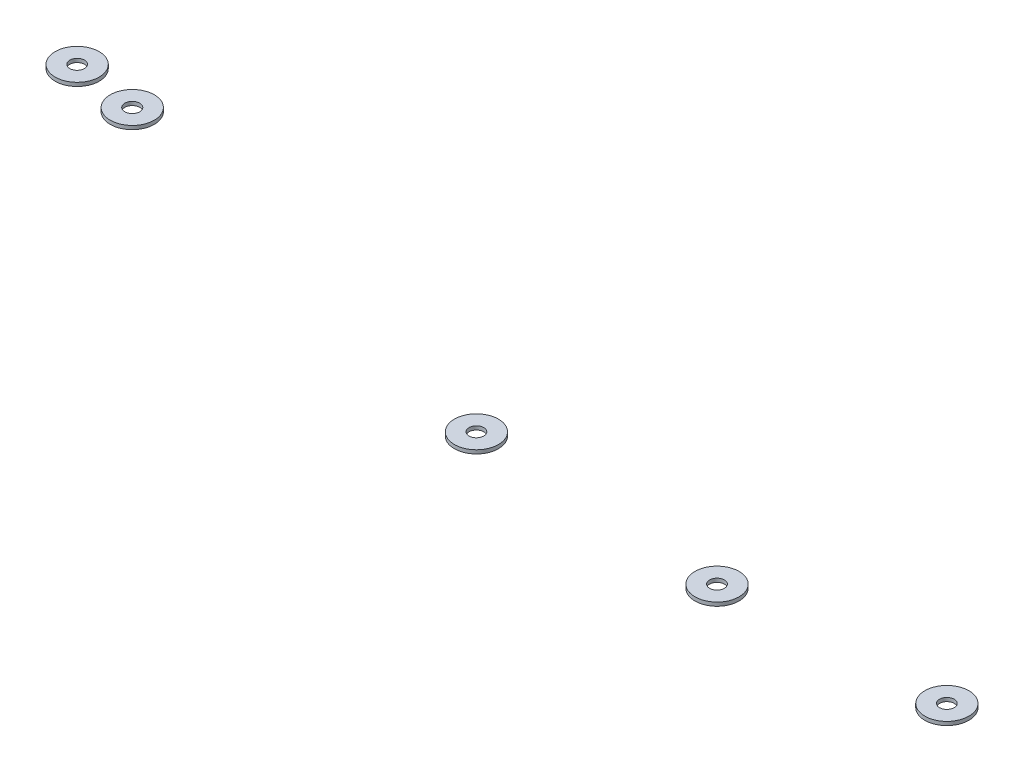
ISO-10303-21;
HEADER;
FILE_DESCRIPTION(('STEP AP214'),'2;1');
FILE_NAME('part.step','',(''),(''),'','','');
FILE_SCHEMA(('AUTOMOTIVE_DESIGN { 1 0 10303 214 1 1 1 1 }'));
ENDSEC;
DATA;
#1=APPLICATION_CONTEXT('core data for automotive mechanical design processes');
#2=APPLICATION_PROTOCOL_DEFINITION('international standard','automotive_design',2000,#1);
#3=PRODUCT_CONTEXT('',#1,'mechanical');
#4=PRODUCT('Part','Part','',(#3));
#5=PRODUCT_RELATED_PRODUCT_CATEGORY('part','',(#4));
#6=PRODUCT_DEFINITION_FORMATION('','',#4);
#7=PRODUCT_DEFINITION_CONTEXT('part definition',#1,'design');
#8=PRODUCT_DEFINITION('design','',#6,#7);
#9=PRODUCT_DEFINITION_SHAPE('','',#8);
#10=(LENGTH_UNIT() NAMED_UNIT(*) SI_UNIT(.MILLI.,.METRE.));
#11=(NAMED_UNIT(*) PLANE_ANGLE_UNIT() SI_UNIT($,.RADIAN.));
#12=(NAMED_UNIT(*) SI_UNIT($,.STERADIAN.) SOLID_ANGLE_UNIT());
#13=UNCERTAINTY_MEASURE_WITH_UNIT(LENGTH_MEASURE(1.E-05),#10,'distance_accuracy_value','');
#14=(GEOMETRIC_REPRESENTATION_CONTEXT(3) GLOBAL_UNCERTAINTY_ASSIGNED_CONTEXT((#13)) GLOBAL_UNIT_ASSIGNED_CONTEXT((#10,
#11,#12)) REPRESENTATION_CONTEXT('',''));
#15=CARTESIAN_POINT('',(0.,0.,0.));
#16=DIRECTION('',(0.,0.,1.));
#17=DIRECTION('',(1.,0.,0.));
#18=AXIS2_PLACEMENT_3D('',#15,#16,#17);
#19=CARTESIAN_POINT('',(-364.051137420954,706.3,-296.101801858513));
#20=DIRECTION('',(0.,1.,0.));
#21=DIRECTION('',(0.,0.,-1.));
#22=AXIS2_PLACEMENT_3D('',#19,#20,#21);
#23=PLANE('',#22);
#24=CARTESIAN_POINT('',(-364.051137420954,706.3,-296.101801858513));
#25=DIRECTION('',(0.,-1.,0.));
#26=DIRECTION('',(0.,0.,-1.));
#27=AXIS2_PLACEMENT_3D('',#24,#25,#26);
#28=CIRCLE('',#27,5.99999999999999);
#29=CARTESIAN_POINT('',(-364.051137420954,706.3,-302.101801858513));
#30=VERTEX_POINT('',#29);
#31=EDGE_CURVE('E11',#30,#30,#28,.T.);
#32=ORIENTED_EDGE('',*,*,#31,.F.);
#33=EDGE_LOOP('',(#32));
#34=FACE_BOUND('',#33,.T.);
#35=CARTESIAN_POINT('',(-364.051137420954,706.3,-296.101801858513));
#36=DIRECTION('',(0.,-1.,0.));
#37=DIRECTION('',(0.,0.,-1.));
#38=AXIS2_PLACEMENT_3D('',#35,#36,#37);
#39=CIRCLE('',#38,2.);
#40=CARTESIAN_POINT('',(-364.051137420954,706.3,-298.101801858513));
#41=VERTEX_POINT('',#40);
#42=EDGE_CURVE('E55',#41,#41,#39,.T.);
#43=ORIENTED_EDGE('',*,*,#42,.T.);
#44=EDGE_LOOP('',(#43));
#45=FACE_BOUND('',#44,.T.);
#46=ADVANCED_FACE('F44',(#34,#45),#23,.T.);
#47=CARTESIAN_POINT('',(-364.051137420954,705.3,-296.101801858513));
#48=DIRECTION('',(0.,1.,0.));
#49=DIRECTION('',(0.,0.,-1.));
#50=AXIS2_PLACEMENT_3D('',#47,#48,#49);
#51=PLANE('',#50);
#52=CARTESIAN_POINT('',(-364.051137420954,705.3,-296.101801858513));
#53=DIRECTION('',(0.,-1.,0.));
#54=DIRECTION('',(0.,0.,-1.));
#55=AXIS2_PLACEMENT_3D('',#52,#53,#54);
#56=CIRCLE('',#55,5.99999999999999);
#57=CARTESIAN_POINT('',(-364.051137420954,705.3,-302.101801858513));
#58=VERTEX_POINT('',#57);
#59=EDGE_CURVE('E48',#58,#58,#56,.T.);
#60=ORIENTED_EDGE('',*,*,#59,.T.);
#61=EDGE_LOOP('',(#60));
#62=FACE_BOUND('',#61,.T.);
#63=CARTESIAN_POINT('',(-364.051137420954,705.3,-296.101801858513));
#64=DIRECTION('',(0.,-1.,0.));
#65=DIRECTION('',(0.,0.,-1.));
#66=AXIS2_PLACEMENT_3D('',#63,#64,#65);
#67=CIRCLE('',#66,2.);
#68=CARTESIAN_POINT('',(-364.051137420954,705.3,-298.101801858513));
#69=VERTEX_POINT('',#68);
#70=EDGE_CURVE('E57',#69,#69,#67,.T.);
#71=ORIENTED_EDGE('',*,*,#70,.F.);
#72=EDGE_LOOP('',(#71));
#73=FACE_BOUND('',#72,.T.);
#74=ADVANCED_FACE('F70',(#62,#73),#51,.F.);
#75=CARTESIAN_POINT('',(-364.051137420954,706.3,-296.101801858513));
#76=DIRECTION('',(0.,-1.,0.));
#77=DIRECTION('',(0.,0.,1.));
#78=AXIS2_PLACEMENT_3D('',#75,#76,#77);
#79=CYLINDRICAL_SURFACE('',#78,5.99999999999999);
#80=ORIENTED_EDGE('',*,*,#31,.T.);
#81=EDGE_LOOP('',(#80));
#82=FACE_BOUND('',#81,.T.);
#83=ORIENTED_EDGE('',*,*,#59,.F.);
#84=EDGE_LOOP('',(#83));
#85=FACE_BOUND('',#84,.T.);
#86=ADVANCED_FACE('F46',(#82,#85),#79,.T.);
#87=CARTESIAN_POINT('',(-364.051137420954,706.3,-296.101801858513));
#88=DIRECTION('',(0.,-1.,0.));
#89=DIRECTION('',(0.,0.,1.));
#90=AXIS2_PLACEMENT_3D('',#87,#88,#89);
#91=CYLINDRICAL_SURFACE('',#90,2.);
#92=ORIENTED_EDGE('',*,*,#42,.F.);
#93=EDGE_LOOP('',(#92));
#94=FACE_BOUND('',#93,.T.);
#95=ORIENTED_EDGE('',*,*,#70,.T.);
#96=EDGE_LOOP('',(#95));
#97=FACE_BOUND('',#96,.T.);
#98=ADVANCED_FACE('F64',(#94,#97),#91,.F.);
#99=CLOSED_SHELL('',(#46,#74,#86,#98));
#100=MANIFOLD_SOLID_BREP('B2',#99);
#101=CARTESIAN_POINT('',(-346.372819063942,706.3,-293.429327819401));
#102=DIRECTION('',(0.,1.,0.));
#103=DIRECTION('',(0.,0.,-1.));
#104=AXIS2_PLACEMENT_3D('',#101,#102,#103);
#105=PLANE('',#104);
#106=CARTESIAN_POINT('',(-346.372819063942,706.3,-293.429327819401));
#107=DIRECTION('',(0.,-1.,0.));
#108=DIRECTION('',(0.,0.,-1.));
#109=AXIS2_PLACEMENT_3D('',#106,#107,#108);
#110=CIRCLE('',#109,5.99999999999999);
#111=CARTESIAN_POINT('',(-346.372819063942,706.3,-299.429327819401));
#112=VERTEX_POINT('',#111);
#113=EDGE_CURVE('E43',#112,#112,#110,.T.);
#114=ORIENTED_EDGE('',*,*,#113,.F.);
#115=EDGE_LOOP('',(#114));
#116=FACE_BOUND('',#115,.T.);
#117=CARTESIAN_POINT('',(-346.372819063942,706.3,-293.429327819401));
#118=DIRECTION('',(0.,-1.,0.));
#119=DIRECTION('',(0.,0.,-1.));
#120=AXIS2_PLACEMENT_3D('',#117,#118,#119);
#121=CIRCLE('',#120,2.0342194785771);
#122=CARTESIAN_POINT('',(-346.372819063942,706.3,-295.463547297979));
#123=VERTEX_POINT('',#122);
#124=EDGE_CURVE('E125',#123,#123,#121,.T.);
#125=ORIENTED_EDGE('',*,*,#124,.T.);
#126=EDGE_LOOP('',(#125));
#127=FACE_BOUND('',#126,.T.);
#128=ADVANCED_FACE('F114',(#116,#127),#105,.T.);
#129=CARTESIAN_POINT('',(-346.372819063942,705.3,-293.429327819401));
#130=DIRECTION('',(0.,1.,0.));
#131=DIRECTION('',(0.,0.,-1.));
#132=AXIS2_PLACEMENT_3D('',#129,#130,#131);
#133=PLANE('',#132);
#134=CARTESIAN_POINT('',(-346.372819063942,705.3,-293.429327819401));
#135=DIRECTION('',(0.,-1.,0.));
#136=DIRECTION('',(0.,0.,-1.));
#137=AXIS2_PLACEMENT_3D('',#134,#135,#136);
#138=CIRCLE('',#137,5.99999999999999);
#139=CARTESIAN_POINT('',(-346.372819063942,705.3,-299.429327819401));
#140=VERTEX_POINT('',#139);
#141=EDGE_CURVE('E118',#140,#140,#138,.T.);
#142=ORIENTED_EDGE('',*,*,#141,.T.);
#143=EDGE_LOOP('',(#142));
#144=FACE_BOUND('',#143,.T.);
#145=CARTESIAN_POINT('',(-346.372819063942,705.3,-293.429327819401));
#146=DIRECTION('',(0.,-1.,0.));
#147=DIRECTION('',(0.,0.,-1.));
#148=AXIS2_PLACEMENT_3D('',#145,#146,#147);
#149=CIRCLE('',#148,2.0342194785771);
#150=CARTESIAN_POINT('',(-346.372819063942,705.3,-295.463547297979));
#151=VERTEX_POINT('',#150);
#152=EDGE_CURVE('E127',#151,#151,#149,.T.);
#153=ORIENTED_EDGE('',*,*,#152,.F.);
#154=EDGE_LOOP('',(#153));
#155=FACE_BOUND('',#154,.T.);
#156=ADVANCED_FACE('F140',(#144,#155),#133,.F.);
#157=CARTESIAN_POINT('',(-346.372819063942,706.3,-293.429327819401));
#158=DIRECTION('',(0.,-1.,0.));
#159=DIRECTION('',(0.,0.,1.));
#160=AXIS2_PLACEMENT_3D('',#157,#158,#159);
#161=CYLINDRICAL_SURFACE('',#160,5.99999999999999);
#162=ORIENTED_EDGE('',*,*,#113,.T.);
#163=EDGE_LOOP('',(#162));
#164=FACE_BOUND('',#163,.T.);
#165=ORIENTED_EDGE('',*,*,#141,.F.);
#166=EDGE_LOOP('',(#165));
#167=FACE_BOUND('',#166,.T.);
#168=ADVANCED_FACE('F116',(#164,#167),#161,.T.);
#169=CARTESIAN_POINT('',(-346.372819063942,706.3,-293.429327819401));
#170=DIRECTION('',(0.,-1.,0.));
#171=DIRECTION('',(0.,0.,1.));
#172=AXIS2_PLACEMENT_3D('',#169,#170,#171);
#173=CYLINDRICAL_SURFACE('',#172,2.0342194785771);
#174=ORIENTED_EDGE('',*,*,#124,.F.);
#175=EDGE_LOOP('',(#174));
#176=FACE_BOUND('',#175,.T.);
#177=ORIENTED_EDGE('',*,*,#152,.T.);
#178=EDGE_LOOP('',(#177));
#179=FACE_BOUND('',#178,.T.);
#180=ADVANCED_FACE('F134',(#176,#179),#173,.F.);
#181=CLOSED_SHELL('',(#128,#156,#168,#180));
#182=MANIFOLD_SOLID_BREP('B6',#181);
#183=CARTESIAN_POINT('',(-223.024834580686,706.3,-263.802212935845));
#184=DIRECTION('',(0.,1.,0.));
#185=DIRECTION('',(0.,0.,-1.));
#186=AXIS2_PLACEMENT_3D('',#183,#184,#185);
#187=PLANE('',#186);
#188=CARTESIAN_POINT('',(-223.024834580686,706.3,-263.802212935845));
#189=DIRECTION('',(0.,-1.,0.));
#190=DIRECTION('',(0.,0.,-1.));
#191=AXIS2_PLACEMENT_3D('',#188,#189,#190);
#192=CIRCLE('',#191,6.00000000000002);
#193=CARTESIAN_POINT('',(-223.024834580686,706.3,-269.802212935845));
#194=VERTEX_POINT('',#193);
#195=EDGE_CURVE('E113',#194,#194,#192,.T.);
#196=ORIENTED_EDGE('',*,*,#195,.F.);
#197=EDGE_LOOP('',(#196));
#198=FACE_BOUND('',#197,.T.);
#199=CARTESIAN_POINT('',(-223.024834580686,706.3,-263.802212935845));
#200=DIRECTION('',(0.,-1.,0.));
#201=DIRECTION('',(0.,0.,-1.));
#202=AXIS2_PLACEMENT_3D('',#199,#200,#201);
#203=CIRCLE('',#202,2.);
#204=CARTESIAN_POINT('',(-223.024834580686,706.3,-265.802212935845));
#205=VERTEX_POINT('',#204);
#206=EDGE_CURVE('E195',#205,#205,#203,.T.);
#207=ORIENTED_EDGE('',*,*,#206,.T.);
#208=EDGE_LOOP('',(#207));
#209=FACE_BOUND('',#208,.T.);
#210=ADVANCED_FACE('F184',(#198,#209),#187,.T.);
#211=CARTESIAN_POINT('',(-223.024834580686,705.3,-263.802212935845));
#212=DIRECTION('',(0.,1.,0.));
#213=DIRECTION('',(0.,0.,-1.));
#214=AXIS2_PLACEMENT_3D('',#211,#212,#213);
#215=PLANE('',#214);
#216=CARTESIAN_POINT('',(-223.024834580686,705.3,-263.802212935845));
#217=DIRECTION('',(0.,-1.,0.));
#218=DIRECTION('',(0.,0.,-1.));
#219=AXIS2_PLACEMENT_3D('',#216,#217,#218);
#220=CIRCLE('',#219,6.00000000000002);
#221=CARTESIAN_POINT('',(-223.024834580686,705.3,-269.802212935845));
#222=VERTEX_POINT('',#221);
#223=EDGE_CURVE('E188',#222,#222,#220,.T.);
#224=ORIENTED_EDGE('',*,*,#223,.T.);
#225=EDGE_LOOP('',(#224));
#226=FACE_BOUND('',#225,.T.);
#227=CARTESIAN_POINT('',(-223.024834580686,705.3,-263.802212935845));
#228=DIRECTION('',(0.,-1.,0.));
#229=DIRECTION('',(0.,0.,-1.));
#230=AXIS2_PLACEMENT_3D('',#227,#228,#229);
#231=CIRCLE('',#230,2.);
#232=CARTESIAN_POINT('',(-223.024834580686,705.3,-265.802212935845));
#233=VERTEX_POINT('',#232);
#234=EDGE_CURVE('E197',#233,#233,#231,.T.);
#235=ORIENTED_EDGE('',*,*,#234,.F.);
#236=EDGE_LOOP('',(#235));
#237=FACE_BOUND('',#236,.T.);
#238=ADVANCED_FACE('F210',(#226,#237),#215,.F.);
#239=CARTESIAN_POINT('',(-223.024834580686,706.3,-263.802212935845));
#240=DIRECTION('',(0.,-1.,0.));
#241=DIRECTION('',(0.,0.,1.));
#242=AXIS2_PLACEMENT_3D('',#239,#240,#241);
#243=CYLINDRICAL_SURFACE('',#242,6.00000000000002);
#244=ORIENTED_EDGE('',*,*,#195,.T.);
#245=EDGE_LOOP('',(#244));
#246=FACE_BOUND('',#245,.T.);
#247=ORIENTED_EDGE('',*,*,#223,.F.);
#248=EDGE_LOOP('',(#247));
#249=FACE_BOUND('',#248,.T.);
#250=ADVANCED_FACE('F186',(#246,#249),#243,.T.);
#251=CARTESIAN_POINT('',(-223.024834580686,706.3,-263.802212935845));
#252=DIRECTION('',(0.,-1.,0.));
#253=DIRECTION('',(0.,0.,1.));
#254=AXIS2_PLACEMENT_3D('',#251,#252,#253);
#255=CYLINDRICAL_SURFACE('',#254,2.);
#256=ORIENTED_EDGE('',*,*,#206,.F.);
#257=EDGE_LOOP('',(#256));
#258=FACE_BOUND('',#257,.T.);
#259=ORIENTED_EDGE('',*,*,#234,.T.);
#260=EDGE_LOOP('',(#259));
#261=FACE_BOUND('',#260,.T.);
#262=ADVANCED_FACE('F204',(#258,#261),#255,.F.);
#263=CLOSED_SHELL('',(#210,#238,#250,#262));
#264=MANIFOLD_SOLID_BREP('B38',#263);
#265=CARTESIAN_POINT('',(-154.344703344319,706.3,-260.643821632466));
#266=DIRECTION('',(0.,1.,0.));
#267=DIRECTION('',(0.,0.,-1.));
#268=AXIS2_PLACEMENT_3D('',#265,#266,#267);
#269=PLANE('',#268);
#270=CARTESIAN_POINT('',(-154.344703344319,706.3,-260.643821632466));
#271=DIRECTION('',(0.,-1.,0.));
#272=DIRECTION('',(0.,0.,-1.));
#273=AXIS2_PLACEMENT_3D('',#270,#271,#272);
#274=CIRCLE('',#273,6.00000000000002);
#275=CARTESIAN_POINT('',(-154.344703344319,706.3,-266.643821632466));
#276=VERTEX_POINT('',#275);
#277=EDGE_CURVE('E183',#276,#276,#274,.T.);
#278=ORIENTED_EDGE('',*,*,#277,.F.);
#279=EDGE_LOOP('',(#278));
#280=FACE_BOUND('',#279,.T.);
#281=CARTESIAN_POINT('',(-154.344703344319,706.3,-260.643821632466));
#282=DIRECTION('',(0.,-1.,0.));
#283=DIRECTION('',(0.,0.,-1.));
#284=AXIS2_PLACEMENT_3D('',#281,#282,#283);
#285=CIRCLE('',#284,2.);
#286=CARTESIAN_POINT('',(-154.344703344319,706.3,-262.643821632466));
#287=VERTEX_POINT('',#286);
#288=EDGE_CURVE('E264',#287,#287,#285,.T.);
#289=ORIENTED_EDGE('',*,*,#288,.T.);
#290=EDGE_LOOP('',(#289));
#291=FACE_BOUND('',#290,.T.);
#292=ADVANCED_FACE('F253',(#280,#291),#269,.T.);
#293=CARTESIAN_POINT('',(-154.344703344319,705.3,-260.643821632466));
#294=DIRECTION('',(0.,1.,0.));
#295=DIRECTION('',(0.,0.,-1.));
#296=AXIS2_PLACEMENT_3D('',#293,#294,#295);
#297=PLANE('',#296);
#298=CARTESIAN_POINT('',(-154.344703344319,705.3,-260.643821632466));
#299=DIRECTION('',(0.,-1.,0.));
#300=DIRECTION('',(0.,0.,-1.));
#301=AXIS2_PLACEMENT_3D('',#298,#299,#300);
#302=CIRCLE('',#301,6.00000000000002);
#303=CARTESIAN_POINT('',(-154.344703344319,705.3,-266.643821632466));
#304=VERTEX_POINT('',#303);
#305=EDGE_CURVE('E257',#304,#304,#302,.T.);
#306=ORIENTED_EDGE('',*,*,#305,.T.);
#307=EDGE_LOOP('',(#306));
#308=FACE_BOUND('',#307,.T.);
#309=CARTESIAN_POINT('',(-154.344703344319,705.3,-260.643821632466));
#310=DIRECTION('',(0.,-1.,0.));
#311=DIRECTION('',(0.,0.,-1.));
#312=AXIS2_PLACEMENT_3D('',#309,#310,#311);
#313=CIRCLE('',#312,2.);
#314=CARTESIAN_POINT('',(-154.344703344319,705.3,-262.643821632466));
#315=VERTEX_POINT('',#314);
#316=EDGE_CURVE('E266',#315,#315,#313,.T.);
#317=ORIENTED_EDGE('',*,*,#316,.F.);
#318=EDGE_LOOP('',(#317));
#319=FACE_BOUND('',#318,.T.);
#320=ADVANCED_FACE('F279',(#308,#319),#297,.F.);
#321=CARTESIAN_POINT('',(-154.344703344319,706.3,-260.643821632466));
#322=DIRECTION('',(0.,-1.,0.));
#323=DIRECTION('',(0.,0.,1.));
#324=AXIS2_PLACEMENT_3D('',#321,#322,#323);
#325=CYLINDRICAL_SURFACE('',#324,6.00000000000002);
#326=ORIENTED_EDGE('',*,*,#277,.T.);
#327=EDGE_LOOP('',(#326));
#328=FACE_BOUND('',#327,.T.);
#329=ORIENTED_EDGE('',*,*,#305,.F.);
#330=EDGE_LOOP('',(#329));
#331=FACE_BOUND('',#330,.T.);
#332=ADVANCED_FACE('F255',(#328,#331),#325,.T.);
#333=CARTESIAN_POINT('',(-154.344703344319,706.3,-260.643821632466));
#334=DIRECTION('',(0.,-1.,0.));
#335=DIRECTION('',(0.,0.,1.));
#336=AXIS2_PLACEMENT_3D('',#333,#334,#335);
#337=CYLINDRICAL_SURFACE('',#336,2.);
#338=ORIENTED_EDGE('',*,*,#288,.F.);
#339=EDGE_LOOP('',(#338));
#340=FACE_BOUND('',#339,.T.);
#341=ORIENTED_EDGE('',*,*,#316,.T.);
#342=EDGE_LOOP('',(#341));
#343=FACE_BOUND('',#342,.T.);
#344=ADVANCED_FACE('F273',(#340,#343),#337,.F.);
#345=CLOSED_SHELL('',(#292,#320,#332,#344));
#346=MANIFOLD_SOLID_BREP('B108',#345);
#347=CARTESIAN_POINT('',(-94.9095215443751,706.3,-263.802212935845));
#348=DIRECTION('',(0.,1.,0.));
#349=DIRECTION('',(0.,0.,-1.));
#350=AXIS2_PLACEMENT_3D('',#347,#348,#349);
#351=PLANE('',#350);
#352=CARTESIAN_POINT('',(-94.9095215443751,706.3,-263.802212935845));
#353=DIRECTION('',(0.,-1.,0.));
#354=DIRECTION('',(0.,0.,-1.));
#355=AXIS2_PLACEMENT_3D('',#352,#353,#354);
#356=CIRCLE('',#355,6.);
#357=CARTESIAN_POINT('',(-94.9095215443751,706.3,-269.802212935845));
#358=VERTEX_POINT('',#357);
#359=EDGE_CURVE('E252',#358,#358,#356,.T.);
#360=ORIENTED_EDGE('',*,*,#359,.F.);
#361=EDGE_LOOP('',(#360));
#362=FACE_BOUND('',#361,.T.);
#363=CARTESIAN_POINT('',(-94.9095215443751,706.3,-263.802212935845));
#364=DIRECTION('',(0.,-1.,0.));
#365=DIRECTION('',(0.,0.,-1.));
#366=AXIS2_PLACEMENT_3D('',#363,#364,#365);
#367=CIRCLE('',#366,2.);
#368=CARTESIAN_POINT('',(-94.9095215443751,706.3,-265.802212935845));
#369=VERTEX_POINT('',#368);
#370=EDGE_CURVE('E326',#369,#369,#367,.T.);
#371=ORIENTED_EDGE('',*,*,#370,.T.);
#372=EDGE_LOOP('',(#371));
#373=FACE_BOUND('',#372,.T.);
#374=ADVANCED_FACE('F315',(#362,#373),#351,.T.);
#375=CARTESIAN_POINT('',(-94.9095215443751,705.3,-263.802212935845));
#376=DIRECTION('',(0.,1.,0.));
#377=DIRECTION('',(0.,0.,-1.));
#378=AXIS2_PLACEMENT_3D('',#375,#376,#377);
#379=PLANE('',#378);
#380=CARTESIAN_POINT('',(-94.9095215443751,705.3,-263.802212935845));
#381=DIRECTION('',(0.,-1.,0.));
#382=DIRECTION('',(0.,0.,-1.));
#383=AXIS2_PLACEMENT_3D('',#380,#381,#382);
#384=CIRCLE('',#383,6.);
#385=CARTESIAN_POINT('',(-94.9095215443751,705.3,-269.802212935845));
#386=VERTEX_POINT('',#385);
#387=EDGE_CURVE('E319',#386,#386,#384,.T.);
#388=ORIENTED_EDGE('',*,*,#387,.T.);
#389=EDGE_LOOP('',(#388));
#390=FACE_BOUND('',#389,.T.);
#391=CARTESIAN_POINT('',(-94.9095215443751,705.3,-263.802212935845));
#392=DIRECTION('',(0.,-1.,0.));
#393=DIRECTION('',(0.,0.,-1.));
#394=AXIS2_PLACEMENT_3D('',#391,#392,#393);
#395=CIRCLE('',#394,2.);
#396=CARTESIAN_POINT('',(-94.9095215443751,705.3,-265.802212935845));
#397=VERTEX_POINT('',#396);
#398=EDGE_CURVE('E328',#397,#397,#395,.T.);
#399=ORIENTED_EDGE('',*,*,#398,.F.);
#400=EDGE_LOOP('',(#399));
#401=FACE_BOUND('',#400,.T.);
#402=ADVANCED_FACE('F341',(#390,#401),#379,.F.);
#403=CARTESIAN_POINT('',(-94.9095215443751,706.3,-263.802212935845));
#404=DIRECTION('',(0.,-1.,0.));
#405=DIRECTION('',(0.,0.,1.));
#406=AXIS2_PLACEMENT_3D('',#403,#404,#405);
#407=CYLINDRICAL_SURFACE('',#406,6.);
#408=ORIENTED_EDGE('',*,*,#359,.T.);
#409=EDGE_LOOP('',(#408));
#410=FACE_BOUND('',#409,.T.);
#411=ORIENTED_EDGE('',*,*,#387,.F.);
#412=EDGE_LOOP('',(#411));
#413=FACE_BOUND('',#412,.T.);
#414=ADVANCED_FACE('F317',(#410,#413),#407,.T.);
#415=CARTESIAN_POINT('',(-94.9095215443751,706.3,-263.802212935845));
#416=DIRECTION('',(0.,-1.,0.));
#417=DIRECTION('',(0.,0.,1.));
#418=AXIS2_PLACEMENT_3D('',#415,#416,#417);
#419=CYLINDRICAL_SURFACE('',#418,2.);
#420=ORIENTED_EDGE('',*,*,#370,.F.);
#421=EDGE_LOOP('',(#420));
#422=FACE_BOUND('',#421,.T.);
#423=ORIENTED_EDGE('',*,*,#398,.T.);
#424=EDGE_LOOP('',(#423));
#425=FACE_BOUND('',#424,.T.);
#426=ADVANCED_FACE('F335',(#422,#425),#419,.F.);
#427=CLOSED_SHELL('',(#374,#402,#414,#426));
#428=MANIFOLD_SOLID_BREP('B178',#427);
#429=ADVANCED_BREP_SHAPE_REPRESENTATION('',(#18,#100,#182,#264,#346,#428),#14);
#430=SHAPE_DEFINITION_REPRESENTATION(#9,#429);
ENDSEC;
END-ISO-10303-21;
